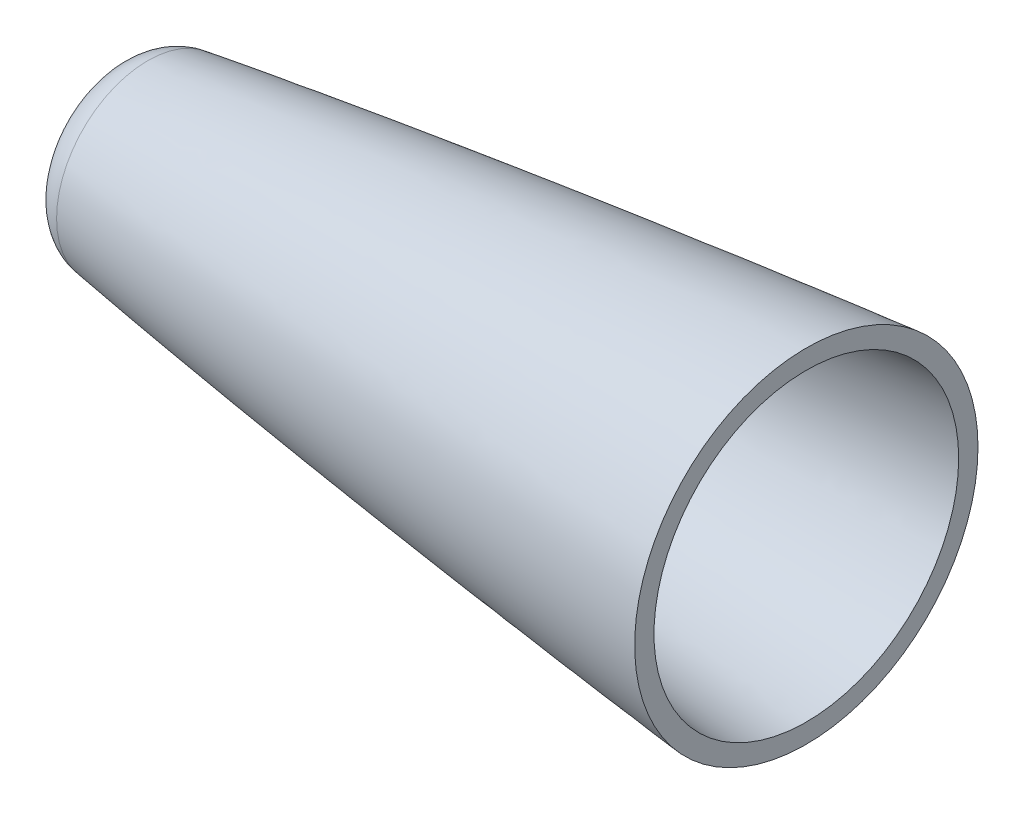
ISO-10303-21;
HEADER;
FILE_DESCRIPTION(('STEP AP214'),'2;1');
FILE_NAME('part.step','',(''),(''),'','','');
FILE_SCHEMA(('AUTOMOTIVE_DESIGN { 1 0 10303 214 1 1 1 1 }'));
ENDSEC;
DATA;
#1=APPLICATION_CONTEXT('core data for automotive mechanical design processes');
#2=APPLICATION_PROTOCOL_DEFINITION('international standard','automotive_design',2000,#1);
#3=PRODUCT_CONTEXT('',#1,'mechanical');
#4=PRODUCT('Part','Part','',(#3));
#5=PRODUCT_RELATED_PRODUCT_CATEGORY('part','',(#4));
#6=PRODUCT_DEFINITION_FORMATION('','',#4);
#7=PRODUCT_DEFINITION_CONTEXT('part definition',#1,'design');
#8=PRODUCT_DEFINITION('design','',#6,#7);
#9=PRODUCT_DEFINITION_SHAPE('','',#8);
#10=(LENGTH_UNIT() NAMED_UNIT(*) SI_UNIT(.MILLI.,.METRE.));
#11=(NAMED_UNIT(*) PLANE_ANGLE_UNIT() SI_UNIT($,.RADIAN.));
#12=(NAMED_UNIT(*) SI_UNIT($,.STERADIAN.) SOLID_ANGLE_UNIT());
#13=UNCERTAINTY_MEASURE_WITH_UNIT(LENGTH_MEASURE(1.E-05),#10,'distance_accuracy_value','');
#14=(GEOMETRIC_REPRESENTATION_CONTEXT(3) GLOBAL_UNCERTAINTY_ASSIGNED_CONTEXT((#13)) GLOBAL_UNIT_ASSIGNED_CONTEXT((#10,
#11,#12)) REPRESENTATION_CONTEXT('',''));
#15=CARTESIAN_POINT('',(0.,0.,0.));
#16=DIRECTION('',(0.,0.,1.));
#17=DIRECTION('',(1.,0.,0.));
#18=AXIS2_PLACEMENT_3D('',#15,#16,#17);
#19=CARTESIAN_POINT('',(-259.812483714893,11.460570284297,0.));
#20=CARTESIAN_POINT('',(-287.312106379697,10.5623408515305,0.));
#21=CARTESIAN_POINT('',(-342.298022137353,8.17156900853598,0.));
#22=CARTESIAN_POINT('',(-452.140135715747,1.83352473554385,0.));
#23=CARTESIAN_POINT('',(-589.280273051557,-8.5121188078909,0.));
#24=CARTESIAN_POINT('',(-726.176632388446,-21.7709007537404,0.));
#25=CARTESIAN_POINT('',(-835.465785428388,-34.5887261399924,0.));
#26=CARTESIAN_POINT('',(-890.027026606975,-41.9652027624198,0.));
#27=CARTESIAN_POINT('',(-917.245364412614,-46.0396236215406,0.));
#28=B_SPLINE_CURVE_WITH_KNOTS('',3,(#19,#20,#21,#22,#23,#24,#25,#26,#27),.UNSPECIFIED.,.F.,.F.,
(4,1,1,1,1,1,4),(0.121539177885851,0.200323508121493,0.279107838357135,0.436676498828419,
0.594245159299703,0.673029489535345,0.751813819770986),.UNSPECIFIED.);
#29=CARTESIAN_POINT('',(0.,-76.2,0.));
#30=DIRECTION('',(1.,0.,0.));
#31=AXIS1_PLACEMENT('',#29,#30);
#32=SURFACE_OF_REVOLUTION('',#28,#31);
#33=CARTESIAN_POINT('',(-917.245364412614,-76.2,0.));
#34=DIRECTION('',(1.,0.,0.));
#35=DIRECTION('',(0.,0.,-1.));
#36=AXIS2_PLACEMENT_3D('',#33,#34,#35);
#37=CIRCLE('',#36,30.1603763784594);
#38=CARTESIAN_POINT('',(-917.245364412614,-76.2,-30.1603763784594));
#39=VERTEX_POINT('',#38);
#40=EDGE_CURVE('E10',#39,#39,#37,.T.);
#41=ORIENTED_EDGE('',*,*,#40,.T.);
#42=EDGE_LOOP('',(#41));
#43=FACE_BOUND('',#42,.T.);
#44=CARTESIAN_POINT('',(-699.4652,-76.2,0.));
#45=DIRECTION('',(1.,0.,0.));
#46=DIRECTION('',(0.,0.,-1.));
#47=AXIS2_PLACEMENT_3D('',#44,#45,#46);
#48=CIRCLE('',#47,56.7704938591752);
#49=CARTESIAN_POINT('',(-699.4652,-76.2,-56.7704938591752));
#50=VERTEX_POINT('',#49);
#51=EDGE_CURVE('E51',#50,#50,#48,.F.);
#52=ORIENTED_EDGE('',*,*,#51,.T.);
#53=EDGE_LOOP('',(#52));
#54=FACE_BOUND('',#53,.T.);
#55=ADVANCED_FACE('F31',(#43,#54),#32,.F.);
#56=CARTESIAN_POINT('',(-259.605182082093,5.11395496327444,0.));
#57=CARTESIAN_POINT('',(-267.12768254606,4.86824499819252,0.));
#58=CARTESIAN_POINT('',(-283.426031509972,4.28566928092725,0.));
#59=CARTESIAN_POINT('',(-317.270262328934,2.88050564552106,0.));
#60=CARTESIAN_POINT('',(-361.130016616179,0.711244662128463,0.));
#61=CARTESIAN_POINT('',(-431.275457268552,-3.37195649395594,0.));
#62=CARTESIAN_POINT('',(-501.372917975129,-8.26687627302136,0.));
#63=CARTESIAN_POINT('',(-571.414486842692,-13.8916826479783,0.));
#64=CARTESIAN_POINT('',(-623.914744737059,-18.4776988889442,0.));
#65=CARTESIAN_POINT('',(-676.380314026956,-23.4393497952148,0.));
#66=CARTESIAN_POINT('',(-728.805663240347,-28.7990620723279,0.));
#67=CARTESIAN_POINT('',(-772.453634614019,-33.627485173269,0.));
#68=CARTESIAN_POINT('',(-807.341816529924,-37.7391545432386,0.));
#69=CARTESIAN_POINT('',(-833.490683910714,-40.9589001471484,0.));
#70=CARTESIAN_POINT('',(-859.619375691871,-44.3289411148186,0.));
#71=CARTESIAN_POINT('',(-885.723877264818,-47.8693351323976,0.));
#72=CARTESIAN_POINT('',(-904.61249297492,-50.577906922154,0.));
#73=CARTESIAN_POINT('',(-914.800968172167,-52.0944643953555,0.));
#74=CARTESIAN_POINT('',(-916.305282206307,-52.3196511250938,0.));
#75=B_SPLINE_CURVE_WITH_KNOTS('',3,(#56,#57,#58,#59,#60,#61,#62,#63,#64,#65,#66,#67,#68,#69,#70,
#71,#72,#73,#74),.UNSPECIFIED.,.F.,.F.,(4,1,1,1,1,1,1,1,1,1,1,1,1,1,1,1,4),(0.121539177885851,
0.143122913317239,0.168303261053087,0.218663956524784,0.26902465199648,0.369746042939873,
0.420106738411569,0.470467433883266,0.520828129354962,0.571188824826659,0.621549520298355,
0.646729868034203,0.671910215770052,0.6970905635059,0.722270911241748,0.747451258977596,
0.751813819770986),.UNSPECIFIED.);
#76=CARTESIAN_POINT('',(0.,-76.2,0.));
#77=DIRECTION('',(1.,0.,0.));
#78=AXIS1_PLACEMENT('',#76,#77);
#79=SURFACE_OF_REVOLUTION('',#75,#78);
#80=CARTESIAN_POINT('',(-916.305282206307,-76.2,0.));
#81=DIRECTION('',(1.,0.,0.));
#82=DIRECTION('',(0.,0.,-1.));
#83=AXIS2_PLACEMENT_3D('',#80,#81,#82);
#84=CIRCLE('',#83,23.8803488749062);
#85=CARTESIAN_POINT('',(-916.305282206307,-76.2,-23.8803488749062));
#86=VERTEX_POINT('',#85);
#87=EDGE_CURVE('E48',#86,#86,#84,.T.);
#88=ORIENTED_EDGE('',*,*,#87,.F.);
#89=EDGE_LOOP('',(#88));
#90=FACE_BOUND('',#89,.T.);
#91=CARTESIAN_POINT('',(-699.4652,-76.2,0.));
#92=DIRECTION('',(1.,0.,0.));
#93=DIRECTION('',(0.,0.,-1.));
#94=AXIS2_PLACEMENT_3D('',#91,#92,#93);
#95=CIRCLE('',#94,50.3825636245439);
#96=CARTESIAN_POINT('',(-699.4652,-76.2,-50.3825636245439));
#97=VERTEX_POINT('',#96);
#98=EDGE_CURVE('E35',#97,#97,#95,.F.);
#99=ORIENTED_EDGE('',*,*,#98,.F.);
#100=EDGE_LOOP('',(#99));
#101=FACE_BOUND('',#100,.T.);
#102=ADVANCED_FACE('F63',(#90,#101),#79,.T.);
#103=CARTESIAN_POINT('',(-915.3652,-76.2,0.));
#104=DIRECTION('',(1.,0.,0.));
#105=DIRECTION('',(0.,0.,-1.));
#106=AXIS2_PLACEMENT_3D('',#103,#104,#105);
#107=TOROIDAL_SURFACE('',#106,17.6003213713529,12.7);
#108=CARTESIAN_POINT('',(-928.0652,-76.2,0.));
#109=DIRECTION('',(1.,0.,0.));
#110=DIRECTION('',(0.,0.,-1.));
#111=AXIS2_PLACEMENT_3D('',#108,#109,#110);
#112=CIRCLE('',#111,17.6003213713529);
#113=CARTESIAN_POINT('',(-928.0652,-76.2,-17.6003213713529));
#114=VERTEX_POINT('',#113);
#115=EDGE_CURVE('E39',#114,#114,#112,.T.);
#116=ORIENTED_EDGE('',*,*,#115,.T.);
#117=EDGE_LOOP('',(#116));
#118=FACE_BOUND('',#117,.T.);
#119=ORIENTED_EDGE('',*,*,#40,.F.);
#120=EDGE_LOOP('',(#119));
#121=FACE_BOUND('',#120,.T.);
#122=ADVANCED_FACE('F67',(#118,#121),#107,.T.);
#123=CARTESIAN_POINT('',(0.,-76.2,0.));
#124=DIRECTION('',(1.,0.,0.));
#125=DIRECTION('',(0.,0.,-1.));
#126=AXIS2_PLACEMENT_3D('',#123,#124,#125);
#127=CYLINDRICAL_SURFACE('',#126,17.6003213713529);
#128=ORIENTED_EDGE('',*,*,#115,.F.);
#129=EDGE_LOOP('',(#128));
#130=FACE_BOUND('',#129,.T.);
#131=CARTESIAN_POINT('',(-921.7152,-76.2,0.));
#132=DIRECTION('',(1.,0.,0.));
#133=DIRECTION('',(0.,0.,-1.));
#134=AXIS2_PLACEMENT_3D('',#131,#132,#133);
#135=CIRCLE('',#134,17.6003213713529);
#136=CARTESIAN_POINT('',(-921.7152,-76.2,-17.6003213713529));
#137=VERTEX_POINT('',#136);
#138=EDGE_CURVE('E43',#137,#137,#135,.T.);
#139=ORIENTED_EDGE('',*,*,#138,.T.);
#140=EDGE_LOOP('',(#139));
#141=FACE_BOUND('',#140,.T.);
#142=ADVANCED_FACE('F73',(#130,#141),#127,.F.);
#143=CARTESIAN_POINT('',(-915.3652,-76.2,0.));
#144=DIRECTION('',(1.,0.,0.));
#145=DIRECTION('',(0.,0.,-1.));
#146=AXIS2_PLACEMENT_3D('',#143,#144,#145);
#147=TOROIDAL_SURFACE('',#146,17.6003213713529,6.35000000000007);
#148=ORIENTED_EDGE('',*,*,#138,.F.);
#149=EDGE_LOOP('',(#148));
#150=FACE_BOUND('',#149,.T.);
#151=ORIENTED_EDGE('',*,*,#87,.T.);
#152=EDGE_LOOP('',(#151));
#153=FACE_BOUND('',#152,.T.);
#154=ADVANCED_FACE('F70',(#150,#153),#147,.F.);
#155=CARTESIAN_POINT('',(-699.4652,-76.2,0.));
#156=DIRECTION('',(1.,0.,0.));
#157=DIRECTION('',(0.,0.,-1.));
#158=AXIS2_PLACEMENT_3D('',#155,#156,#157);
#159=PLANE('',#158);
#160=ORIENTED_EDGE('',*,*,#51,.F.);
#161=EDGE_LOOP('',(#160));
#162=FACE_BOUND('',#161,.T.);
#163=ORIENTED_EDGE('',*,*,#98,.T.);
#164=EDGE_LOOP('',(#163));
#165=FACE_BOUND('',#164,.T.);
#166=ADVANCED_FACE('F69',(#162,#165),#159,.T.);
#167=CLOSED_SHELL('',(#55,#102,#122,#142,#154,#166));
#168=MANIFOLD_SOLID_BREP('B2',#167);
#169=ADVANCED_BREP_SHAPE_REPRESENTATION('',(#18,#168),#14);
#170=SHAPE_DEFINITION_REPRESENTATION(#9,#169);
ENDSEC;
END-ISO-10303-21;
